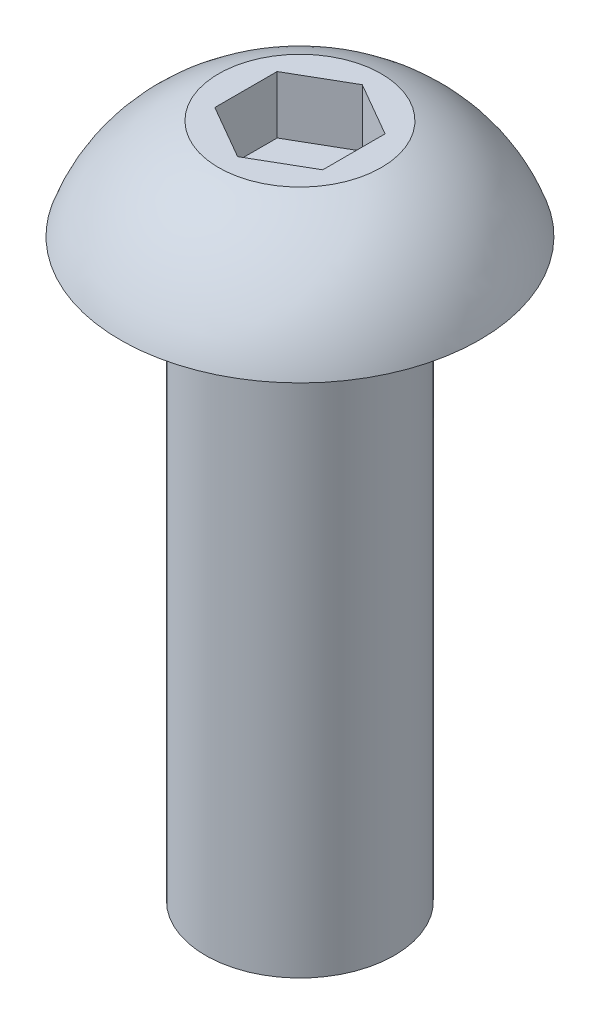
ISO-10303-21;
HEADER;
FILE_DESCRIPTION(('STEP AP214'),'2;1');
FILE_NAME('part.step','',(''),(''),'','','');
FILE_SCHEMA(('AUTOMOTIVE_DESIGN { 1 0 10303 214 1 1 1 1 }'));
ENDSEC;
DATA;
#1=APPLICATION_CONTEXT('core data for automotive mechanical design processes');
#2=APPLICATION_PROTOCOL_DEFINITION('international standard','automotive_design',2000,#1);
#3=PRODUCT_CONTEXT('',#1,'mechanical');
#4=PRODUCT('Part','Part','',(#3));
#5=PRODUCT_RELATED_PRODUCT_CATEGORY('part','',(#4));
#6=PRODUCT_DEFINITION_FORMATION('','',#4);
#7=PRODUCT_DEFINITION_CONTEXT('part definition',#1,'design');
#8=PRODUCT_DEFINITION('design','',#6,#7);
#9=PRODUCT_DEFINITION_SHAPE('','',#8);
#10=(LENGTH_UNIT() NAMED_UNIT(*) SI_UNIT(.MILLI.,.METRE.));
#11=(NAMED_UNIT(*) PLANE_ANGLE_UNIT() SI_UNIT($,.RADIAN.));
#12=(NAMED_UNIT(*) SI_UNIT($,.STERADIAN.) SOLID_ANGLE_UNIT());
#13=UNCERTAINTY_MEASURE_WITH_UNIT(LENGTH_MEASURE(1.E-05),#10,'distance_accuracy_value','');
#14=(GEOMETRIC_REPRESENTATION_CONTEXT(3) GLOBAL_UNCERTAINTY_ASSIGNED_CONTEXT((#13)) GLOBAL_UNIT_ASSIGNED_CONTEXT((#10,
#11,#12)) REPRESENTATION_CONTEXT('',''));
#15=CARTESIAN_POINT('',(0.,0.,0.));
#16=DIRECTION('',(0.,0.,1.));
#17=DIRECTION('',(1.,0.,0.));
#18=AXIS2_PLACEMENT_3D('',#15,#16,#17);
#19=CARTESIAN_POINT('',(0.,-12.7,0.));
#20=DIRECTION('',(0.,-1.,0.));
#21=DIRECTION('',(1.,0.,0.));
#22=AXIS2_PLACEMENT_3D('',#19,#20,#21);
#23=CYLINDRICAL_SURFACE('',#22,2.0828);
#24=CARTESIAN_POINT('',(0.,-12.7,0.));
#25=DIRECTION('',(0.,-1.,0.));
#26=DIRECTION('',(1.,0.,0.));
#27=AXIS2_PLACEMENT_3D('',#24,#25,#26);
#28=CIRCLE('',#27,2.0828);
#29=CARTESIAN_POINT('',(2.0828,-12.7,0.));
#30=VERTEX_POINT('',#29);
#31=EDGE_CURVE('E136',#30,#30,#28,.T.);
#32=ORIENTED_EDGE('',*,*,#31,.F.);
#33=EDGE_LOOP('',(#32));
#34=FACE_BOUND('',#33,.T.);
#35=CARTESIAN_POINT('',(0.,0.,0.));
#36=DIRECTION('',(0.,-1.,0.));
#37=DIRECTION('',(1.,0.,0.));
#38=AXIS2_PLACEMENT_3D('',#35,#36,#37);
#39=CIRCLE('',#38,2.0828);
#40=CARTESIAN_POINT('',(2.0828,0.,0.));
#41=VERTEX_POINT('',#40);
#42=EDGE_CURVE('E11',#41,#41,#39,.T.);
#43=ORIENTED_EDGE('',*,*,#42,.T.);
#44=EDGE_LOOP('',(#43));
#45=FACE_BOUND('',#44,.T.);
#46=ADVANCED_FACE('F35',(#34,#45),#23,.T.);
#47=CARTESIAN_POINT('',(-2.0828,0.,0.));
#48=DIRECTION('',(0.,1.,0.));
#49=DIRECTION('',(-1.,0.,0.));
#50=AXIS2_PLACEMENT_3D('',#47,#48,#49);
#51=PLANE('',#50);
#52=ORIENTED_EDGE('',*,*,#42,.F.);
#53=EDGE_LOOP('',(#52));
#54=FACE_BOUND('',#53,.T.);
#55=CARTESIAN_POINT('',(0.,0.,0.));
#56=DIRECTION('',(0.,-1.,0.));
#57=DIRECTION('',(1.,0.,0.));
#58=AXIS2_PLACEMENT_3D('',#55,#56,#57);
#59=CIRCLE('',#58,3.9624);
#60=CARTESIAN_POINT('',(3.9624,0.,0.));
#61=VERTEX_POINT('',#60);
#62=EDGE_CURVE('E42',#61,#61,#59,.T.);
#63=ORIENTED_EDGE('',*,*,#62,.T.);
#64=EDGE_LOOP('',(#63));
#65=FACE_BOUND('',#64,.T.);
#66=ADVANCED_FACE('F149',(#54,#65),#51,.F.);
#67=CARTESIAN_POINT('',(0.,-1.14110107621728,0.));
#68=DIRECTION('',(0.,-1.,0.));
#69=DIRECTION('',(1.,0.,0.));
#70=AXIS2_PLACEMENT_3D('',#67,#68,#69);
#71=DEGENERATE_TOROIDAL_SURFACE('',#70,0.588889242879197,3.5612759643917,.T.);
#72=ORIENTED_EDGE('',*,*,#62,.F.);
#73=EDGE_LOOP('',(#72));
#74=FACE_BOUND('',#73,.T.);
#75=CARTESIAN_POINT('',(0.,2.2098,0.));
#76=DIRECTION('',(0.,-1.,0.));
#77=DIRECTION('',(1.,0.,0.));
#78=AXIS2_PLACEMENT_3D('',#75,#76,#77);
#79=CIRCLE('',#78,1.7947700296736);
#80=CARTESIAN_POINT('',(1.7947700296736,2.2098,0.));
#81=VERTEX_POINT('',#80);
#82=EDGE_CURVE('E144',#81,#81,#79,.T.);
#83=ORIENTED_EDGE('',*,*,#82,.T.);
#84=EDGE_LOOP('',(#83));
#85=FACE_BOUND('',#84,.T.);
#86=ADVANCED_FACE('F151',(#74,#85),#71,.T.);
#87=CARTESIAN_POINT('',(0.,2.2098,0.));
#88=DIRECTION('',(0.,-1.,0.));
#89=DIRECTION('',(1.,0.,0.));
#90=AXIS2_PLACEMENT_3D('',#87,#88,#89);
#91=PLANE('',#90);
#92=DIRECTION('',(0.,0.,1.));
#93=VECTOR('',#92,1.);
#94=CARTESIAN_POINT('',(-1.190625,2.2098,-0.687407664253898));
#95=LINE('',#94,#93);
#96=CARTESIAN_POINT('',(-1.190625,2.2098,-0.687407664253898));
#97=VERTEX_POINT('',#96);
#98=CARTESIAN_POINT('',(-1.190625,2.2098,0.687407664253898));
#99=VERTEX_POINT('',#98);
#100=EDGE_CURVE('E123',#97,#99,#95,.T.);
#101=ORIENTED_EDGE('',*,*,#100,.F.);
#102=DIRECTION('',(-0.866025403784439,0.,0.5));
#103=VECTOR('',#102,1.);
#104=CARTESIAN_POINT('',(0.,2.2098,-1.3748153285078));
#105=LINE('',#104,#103);
#106=CARTESIAN_POINT('',(0.,2.2098,-1.3748153285078));
#107=VERTEX_POINT('',#106);
#108=EDGE_CURVE('E49',#107,#97,#105,.T.);
#109=ORIENTED_EDGE('',*,*,#108,.F.);
#110=DIRECTION('',(-0.866025403784439,0.,-0.5));
#111=VECTOR('',#110,1.);
#112=CARTESIAN_POINT('',(1.190625,2.2098,-0.687407664253898));
#113=LINE('',#112,#111);
#114=CARTESIAN_POINT('',(1.190625,2.2098,-0.687407664253898));
#115=VERTEX_POINT('',#114);
#116=EDGE_CURVE('E132',#115,#107,#113,.T.);
#117=ORIENTED_EDGE('',*,*,#116,.F.);
#118=DIRECTION('',(0.,0.,-1.));
#119=VECTOR('',#118,1.);
#120=CARTESIAN_POINT('',(1.190625,2.2098,0.687407664253898));
#121=LINE('',#120,#119);
#122=CARTESIAN_POINT('',(1.190625,2.2098,0.687407664253898));
#123=VERTEX_POINT('',#122);
#124=EDGE_CURVE('E130',#123,#115,#121,.T.);
#125=ORIENTED_EDGE('',*,*,#124,.F.);
#126=DIRECTION('',(0.866025403784438,0.,-0.5));
#127=VECTOR('',#126,1.);
#128=CARTESIAN_POINT('',(0.,2.2098,1.3748153285078));
#129=LINE('',#128,#127);
#130=CARTESIAN_POINT('',(0.,2.2098,1.3748153285078));
#131=VERTEX_POINT('',#130);
#132=EDGE_CURVE('E97',#131,#123,#129,.T.);
#133=ORIENTED_EDGE('',*,*,#132,.F.);
#134=DIRECTION('',(0.866025403784439,0.,0.5));
#135=VECTOR('',#134,1.);
#136=CARTESIAN_POINT('',(-1.190625,2.2098,0.687407664253898));
#137=LINE('',#136,#135);
#138=EDGE_CURVE('E126',#99,#131,#137,.T.);
#139=ORIENTED_EDGE('',*,*,#138,.F.);
#140=EDGE_LOOP('',(#101,#109,#117,#125,#133,#139));
#141=FACE_BOUND('',#140,.T.);
#142=ORIENTED_EDGE('',*,*,#82,.F.);
#143=EDGE_LOOP('',(#142));
#144=FACE_BOUND('',#143,.T.);
#145=ADVANCED_FACE('F154',(#141,#144),#91,.F.);
#146=CARTESIAN_POINT('',(-2.0828,-12.7,0.));
#147=DIRECTION('',(0.,1.,0.));
#148=DIRECTION('',(-1.,0.,0.));
#149=AXIS2_PLACEMENT_3D('',#146,#147,#148);
#150=PLANE('',#149);
#151=ORIENTED_EDGE('',*,*,#31,.T.);
#152=EDGE_LOOP('',(#151));
#153=FACE_BOUND('',#152,.T.);
#154=ADVANCED_FACE('F159',(#153),#150,.F.);
#155=CARTESIAN_POINT('',(0.,0.939799999999999,-1.3748153285078));
#156=DIRECTION('',(-0.5,0.,-0.866025403784439));
#157=DIRECTION('',(-0.866025403784439,0.,0.5));
#158=AXIS2_PLACEMENT_3D('',#155,#156,#157);
#159=PLANE('',#158);
#160=ORIENTED_EDGE('',*,*,#108,.T.);
#161=DIRECTION('',(0.,1.,0.));
#162=VECTOR('',#161,1.);
#163=CARTESIAN_POINT('',(-1.190625,0.939799999999999,-0.687407664253898));
#164=LINE('',#163,#162);
#165=CARTESIAN_POINT('',(-1.190625,0.939799999999999,-0.687407664253898));
#166=VERTEX_POINT('',#165);
#167=EDGE_CURVE('E79',#166,#97,#164,.T.);
#168=ORIENTED_EDGE('',*,*,#167,.F.);
#169=DIRECTION('',(-0.866025403784439,0.,0.5));
#170=VECTOR('',#169,1.);
#171=CARTESIAN_POINT('',(0.,0.939799999999999,-1.3748153285078));
#172=LINE('',#171,#170);
#173=CARTESIAN_POINT('',(0.,0.939799999999999,-1.3748153285078));
#174=VERTEX_POINT('',#173);
#175=EDGE_CURVE('E134',#174,#166,#172,.T.);
#176=ORIENTED_EDGE('',*,*,#175,.F.);
#177=DIRECTION('',(0.,1.,0.));
#178=VECTOR('',#177,1.);
#179=CARTESIAN_POINT('',(0.,0.939799999999999,-1.3748153285078));
#180=LINE('',#179,#178);
#181=EDGE_CURVE('E57',#174,#107,#180,.T.);
#182=ORIENTED_EDGE('',*,*,#181,.T.);
#183=EDGE_LOOP('',(#160,#168,#176,#182));
#184=FACE_BOUND('',#183,.T.);
#185=ADVANCED_FACE('F165',(#184),#159,.F.);
#186=CARTESIAN_POINT('',(1.190625,0.939799999999999,-0.687407664253898));
#187=DIRECTION('',(0.5,0.,-0.866025403784439));
#188=DIRECTION('',(-0.866025403784439,0.,-0.5));
#189=AXIS2_PLACEMENT_3D('',#186,#187,#188);
#190=PLANE('',#189);
#191=ORIENTED_EDGE('',*,*,#116,.T.);
#192=ORIENTED_EDGE('',*,*,#181,.F.);
#193=DIRECTION('',(-0.866025403784439,0.,-0.5));
#194=VECTOR('',#193,1.);
#195=CARTESIAN_POINT('',(1.190625,0.939799999999999,-0.687407664253898));
#196=LINE('',#195,#194);
#197=CARTESIAN_POINT('',(1.190625,0.939799999999999,-0.687407664253898));
#198=VERTEX_POINT('',#197);
#199=EDGE_CURVE('E109',#198,#174,#196,.T.);
#200=ORIENTED_EDGE('',*,*,#199,.F.);
#201=DIRECTION('',(0.,1.,0.));
#202=VECTOR('',#201,1.);
#203=CARTESIAN_POINT('',(1.190625,0.939799999999999,-0.687407664253898));
#204=LINE('',#203,#202);
#205=EDGE_CURVE('E101',#198,#115,#204,.T.);
#206=ORIENTED_EDGE('',*,*,#205,.T.);
#207=EDGE_LOOP('',(#191,#192,#200,#206));
#208=FACE_BOUND('',#207,.T.);
#209=ADVANCED_FACE('F203',(#208),#190,.F.);
#210=CARTESIAN_POINT('',(1.190625,0.939799999999999,0.687407664253898));
#211=DIRECTION('',(1.,0.,0.));
#212=DIRECTION('',(0.,0.,-1.));
#213=AXIS2_PLACEMENT_3D('',#210,#211,#212);
#214=PLANE('',#213);
#215=ORIENTED_EDGE('',*,*,#124,.T.);
#216=ORIENTED_EDGE('',*,*,#205,.F.);
#217=DIRECTION('',(0.,0.,-1.));
#218=VECTOR('',#217,1.);
#219=CARTESIAN_POINT('',(1.190625,0.939799999999999,0.687407664253898));
#220=LINE('',#219,#218);
#221=CARTESIAN_POINT('',(1.190625,0.939799999999999,0.687407664253898));
#222=VERTEX_POINT('',#221);
#223=EDGE_CURVE('E105',#222,#198,#220,.T.);
#224=ORIENTED_EDGE('',*,*,#223,.F.);
#225=DIRECTION('',(0.,1.,0.));
#226=VECTOR('',#225,1.);
#227=CARTESIAN_POINT('',(1.190625,0.939799999999999,0.687407664253898));
#228=LINE('',#227,#226);
#229=EDGE_CURVE('E90',#222,#123,#228,.T.);
#230=ORIENTED_EDGE('',*,*,#229,.T.);
#231=EDGE_LOOP('',(#215,#216,#224,#230));
#232=FACE_BOUND('',#231,.T.);
#233=ADVANCED_FACE('F106',(#232),#214,.F.);
#234=CARTESIAN_POINT('',(0.,0.939799999999999,1.3748153285078));
#235=DIRECTION('',(0.5,0.,0.866025403784438));
#236=DIRECTION('',(0.866025403784439,0.,-0.5));
#237=AXIS2_PLACEMENT_3D('',#234,#235,#236);
#238=PLANE('',#237);
#239=ORIENTED_EDGE('',*,*,#132,.T.);
#240=ORIENTED_EDGE('',*,*,#229,.F.);
#241=DIRECTION('',(0.866025403784438,0.,-0.5));
#242=VECTOR('',#241,1.);
#243=CARTESIAN_POINT('',(0.,0.939799999999999,1.3748153285078));
#244=LINE('',#243,#242);
#245=CARTESIAN_POINT('',(0.,0.939799999999999,1.3748153285078));
#246=VERTEX_POINT('',#245);
#247=EDGE_CURVE('E94',#246,#222,#244,.T.);
#248=ORIENTED_EDGE('',*,*,#247,.F.);
#249=DIRECTION('',(0.,1.,0.));
#250=VECTOR('',#249,1.);
#251=CARTESIAN_POINT('',(0.,0.939799999999999,1.3748153285078));
#252=LINE('',#251,#250);
#253=EDGE_CURVE('E102',#246,#131,#252,.T.);
#254=ORIENTED_EDGE('',*,*,#253,.T.);
#255=EDGE_LOOP('',(#239,#240,#248,#254));
#256=FACE_BOUND('',#255,.T.);
#257=ADVANCED_FACE('F92',(#256),#238,.F.);
#258=CARTESIAN_POINT('',(-1.190625,0.939799999999999,0.687407664253898));
#259=DIRECTION('',(-0.5,0.,0.866025403784439));
#260=DIRECTION('',(0.866025403784439,0.,0.5));
#261=AXIS2_PLACEMENT_3D('',#258,#259,#260);
#262=PLANE('',#261);
#263=ORIENTED_EDGE('',*,*,#138,.T.);
#264=ORIENTED_EDGE('',*,*,#253,.F.);
#265=DIRECTION('',(0.866025403784439,0.,0.5));
#266=VECTOR('',#265,1.);
#267=CARTESIAN_POINT('',(-1.190625,0.939799999999999,0.687407664253898));
#268=LINE('',#267,#266);
#269=CARTESIAN_POINT('',(-1.190625,0.939799999999999,0.687407664253898));
#270=VERTEX_POINT('',#269);
#271=EDGE_CURVE('E115',#270,#246,#268,.T.);
#272=ORIENTED_EDGE('',*,*,#271,.F.);
#273=DIRECTION('',(0.,1.,0.));
#274=VECTOR('',#273,1.);
#275=CARTESIAN_POINT('',(-1.190625,0.939799999999999,0.687407664253898));
#276=LINE('',#275,#274);
#277=EDGE_CURVE('E139',#270,#99,#276,.T.);
#278=ORIENTED_EDGE('',*,*,#277,.T.);
#279=EDGE_LOOP('',(#263,#264,#272,#278));
#280=FACE_BOUND('',#279,.T.);
#281=ADVANCED_FACE('F228',(#280),#262,.F.);
#282=CARTESIAN_POINT('',(-1.190625,0.939799999999999,-0.687407664253898));
#283=DIRECTION('',(-1.,0.,0.));
#284=DIRECTION('',(0.,0.,1.));
#285=AXIS2_PLACEMENT_3D('',#282,#283,#284);
#286=PLANE('',#285);
#287=ORIENTED_EDGE('',*,*,#100,.T.);
#288=ORIENTED_EDGE('',*,*,#277,.F.);
#289=DIRECTION('',(0.,0.,1.));
#290=VECTOR('',#289,1.);
#291=CARTESIAN_POINT('',(-1.190625,0.939799999999999,-0.687407664253898));
#292=LINE('',#291,#290);
#293=EDGE_CURVE('E117',#166,#270,#292,.T.);
#294=ORIENTED_EDGE('',*,*,#293,.F.);
#295=ORIENTED_EDGE('',*,*,#167,.T.);
#296=EDGE_LOOP('',(#287,#288,#294,#295));
#297=FACE_BOUND('',#296,.T.);
#298=ADVANCED_FACE('F237',(#297),#286,.F.);
#299=CARTESIAN_POINT('',(0.,0.939799999999999,0.));
#300=DIRECTION('',(0.,1.,0.));
#301=DIRECTION('',(0.,0.,1.));
#302=AXIS2_PLACEMENT_3D('',#299,#300,#301);
#303=PLANE('',#302);
#304=ORIENTED_EDGE('',*,*,#175,.T.);
#305=ORIENTED_EDGE('',*,*,#293,.T.);
#306=ORIENTED_EDGE('',*,*,#271,.T.);
#307=ORIENTED_EDGE('',*,*,#247,.T.);
#308=ORIENTED_EDGE('',*,*,#223,.T.);
#309=ORIENTED_EDGE('',*,*,#199,.T.);
#310=EDGE_LOOP('',(#304,#305,#306,#307,#308,#309));
#311=FACE_BOUND('',#310,.T.);
#312=ADVANCED_FACE('F112',(#311),#303,.T.);
#313=CLOSED_SHELL('',(#46,#66,#86,#145,#154,#185,#209,#233,#257,#281,#298,#312));
#314=MANIFOLD_SOLID_BREP('B2',#313);
#315=ADVANCED_BREP_SHAPE_REPRESENTATION('',(#18,#314),#14);
#316=SHAPE_DEFINITION_REPRESENTATION(#9,#315);
ENDSEC;
END-ISO-10303-21;
